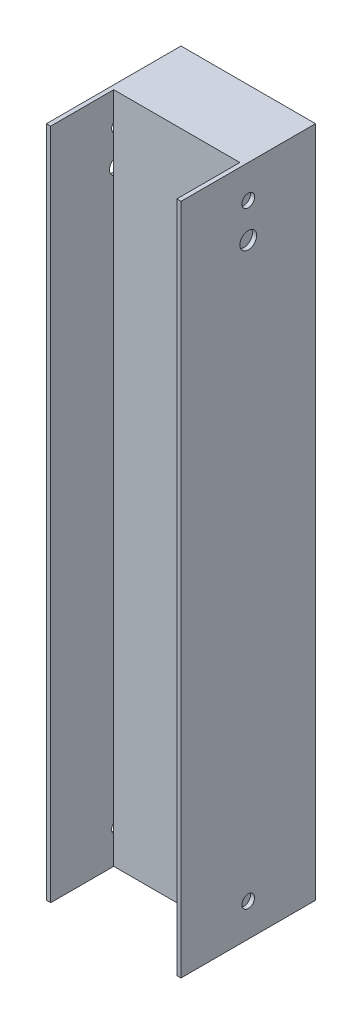
ISO-10303-21;
HEADER;
FILE_DESCRIPTION(('STEP AP214'),'2;1');
FILE_NAME('part.step','',(''),(''),'','','');
FILE_SCHEMA(('AUTOMOTIVE_DESIGN { 1 0 10303 214 1 1 1 1 }'));
ENDSEC;
DATA;
#1=APPLICATION_CONTEXT('core data for automotive mechanical design processes');
#2=APPLICATION_PROTOCOL_DEFINITION('international standard','automotive_design',2000,#1);
#3=PRODUCT_CONTEXT('',#1,'mechanical');
#4=PRODUCT('Part','Part','',(#3));
#5=PRODUCT_RELATED_PRODUCT_CATEGORY('part','',(#4));
#6=PRODUCT_DEFINITION_FORMATION('','',#4);
#7=PRODUCT_DEFINITION_CONTEXT('part definition',#1,'design');
#8=PRODUCT_DEFINITION('design','',#6,#7);
#9=PRODUCT_DEFINITION_SHAPE('','',#8);
#10=(LENGTH_UNIT() NAMED_UNIT(*) SI_UNIT(.MILLI.,.METRE.));
#11=(NAMED_UNIT(*) PLANE_ANGLE_UNIT() SI_UNIT($,.RADIAN.));
#12=(NAMED_UNIT(*) SI_UNIT($,.STERADIAN.) SOLID_ANGLE_UNIT());
#13=UNCERTAINTY_MEASURE_WITH_UNIT(LENGTH_MEASURE(1.E-05),#10,'distance_accuracy_value','');
#14=(GEOMETRIC_REPRESENTATION_CONTEXT(3) GLOBAL_UNCERTAINTY_ASSIGNED_CONTEXT((#13)) GLOBAL_UNIT_ASSIGNED_CONTEXT((#10,
#11,#12)) REPRESENTATION_CONTEXT('',''));
#15=CARTESIAN_POINT('',(0.,0.,0.));
#16=DIRECTION('',(0.,0.,1.));
#17=DIRECTION('',(1.,0.,0.));
#18=AXIS2_PLACEMENT_3D('',#15,#16,#17);
#19=CARTESIAN_POINT('',(-25.4,254.,25.4));
#20=DIRECTION('',(0.,0.,-1.));
#21=DIRECTION('',(-1.,0.,0.));
#22=AXIS2_PLACEMENT_3D('',#19,#20,#21);
#23=PLANE('',#22);
#24=DIRECTION('',(1.,0.,0.));
#25=VECTOR('',#24,1.);
#26=CARTESIAN_POINT('',(-25.4,0.,25.4));
#27=LINE('',#26,#25);
#28=CARTESIAN_POINT('',(-25.4,0.,25.4));
#29=VERTEX_POINT('',#28);
#30=CARTESIAN_POINT('',(-23.8125,0.,25.4));
#31=VERTEX_POINT('',#30);
#32=EDGE_CURVE('E218',#29,#31,#27,.T.);
#33=ORIENTED_EDGE('',*,*,#32,.T.);
#34=DIRECTION('',(0.,-1.,0.));
#35=VECTOR('',#34,1.);
#36=CARTESIAN_POINT('',(-23.8125,254.001,25.4));
#37=LINE('',#36,#35);
#38=CARTESIAN_POINT('',(-23.8125,254.,25.4));
#39=VERTEX_POINT('',#38);
#40=EDGE_CURVE('E310',#39,#31,#37,.T.);
#41=ORIENTED_EDGE('',*,*,#40,.F.);
#42=DIRECTION('',(1.,0.,0.));
#43=VECTOR('',#42,1.);
#44=CARTESIAN_POINT('',(-25.4,254.,25.4));
#45=LINE('',#44,#43);
#46=CARTESIAN_POINT('',(-25.4,254.,25.4));
#47=VERTEX_POINT('',#46);
#48=EDGE_CURVE('E98',#47,#39,#45,.T.);
#49=ORIENTED_EDGE('',*,*,#48,.F.);
#50=DIRECTION('',(0.,-1.,0.));
#51=VECTOR('',#50,1.);
#52=CARTESIAN_POINT('',(-25.4,254.,25.4));
#53=LINE('',#52,#51);
#54=EDGE_CURVE('E11',#47,#29,#53,.T.);
#55=ORIENTED_EDGE('',*,*,#54,.T.);
#56=EDGE_LOOP('',(#33,#41,#49,#55));
#57=FACE_BOUND('',#56,.T.);
#58=ADVANCED_FACE('F43',(#57),#23,.F.);
#59=CARTESIAN_POINT('',(0.,254.,0.));
#60=DIRECTION('',(0.,1.,0.));
#61=DIRECTION('',(0.,0.,1.));
#62=AXIS2_PLACEMENT_3D('',#59,#60,#61);
#63=PLANE('',#62);
#64=DIRECTION('',(0.,0.,1.));
#65=VECTOR('',#64,1.);
#66=CARTESIAN_POINT('',(-23.8125,254.,-23.8125));
#67=LINE('',#66,#65);
#68=CARTESIAN_POINT('',(-23.8125,254.,1.5875));
#69=VERTEX_POINT('',#68);
#70=EDGE_CURVE('E178',#69,#39,#67,.T.);
#71=ORIENTED_EDGE('',*,*,#70,.F.);
#72=DIRECTION('',(-1.,0.,0.));
#73=VECTOR('',#72,1.);
#74=CARTESIAN_POINT('',(-23.8125,254.,1.5875));
#75=LINE('',#74,#73);
#76=CARTESIAN_POINT('',(23.8125,254.,1.5875));
#77=VERTEX_POINT('',#76);
#78=EDGE_CURVE('E162',#77,#69,#75,.T.);
#79=ORIENTED_EDGE('',*,*,#78,.F.);
#80=DIRECTION('',(0.,0.,-1.));
#81=VECTOR('',#80,1.);
#82=CARTESIAN_POINT('',(23.8125,254.,-23.8125));
#83=LINE('',#82,#81);
#84=CARTESIAN_POINT('',(23.8125,254.,25.4));
#85=VERTEX_POINT('',#84);
#86=EDGE_CURVE('E176',#85,#77,#83,.T.);
#87=ORIENTED_EDGE('',*,*,#86,.F.);
#88=CARTESIAN_POINT('',(25.4,254.,25.4));
#89=VERTEX_POINT('',#88);
#90=EDGE_CURVE('E209',#85,#89,#45,.T.);
#91=ORIENTED_EDGE('',*,*,#90,.T.);
#92=DIRECTION('',(0.,0.,-1.));
#93=VECTOR('',#92,1.);
#94=CARTESIAN_POINT('',(25.4,254.,-25.4));
#95=LINE('',#94,#93);
#96=CARTESIAN_POINT('',(25.4,254.,-25.4));
#97=VERTEX_POINT('',#96);
#98=EDGE_CURVE('E212',#89,#97,#95,.T.);
#99=ORIENTED_EDGE('',*,*,#98,.T.);
#100=DIRECTION('',(-1.,0.,0.));
#101=VECTOR('',#100,1.);
#102=CARTESIAN_POINT('',(-25.4,254.,-25.4));
#103=LINE('',#102,#101);
#104=CARTESIAN_POINT('',(-25.4,254.,-25.4));
#105=VERTEX_POINT('',#104);
#106=EDGE_CURVE('E70',#97,#105,#103,.T.);
#107=ORIENTED_EDGE('',*,*,#106,.T.);
#108=DIRECTION('',(0.,0.,1.));
#109=VECTOR('',#108,1.);
#110=CARTESIAN_POINT('',(-25.4,254.,-25.4));
#111=LINE('',#110,#109);
#112=EDGE_CURVE('E206',#105,#47,#111,.T.);
#113=ORIENTED_EDGE('',*,*,#112,.T.);
#114=ORIENTED_EDGE('',*,*,#48,.T.);
#115=EDGE_LOOP('',(#71,#79,#87,#91,#99,#107,#113,#114));
#116=FACE_BOUND('',#115,.T.);
#117=ADVANCED_FACE('F175',(#116),#63,.T.);
#118=CARTESIAN_POINT('',(0.,0.,0.));
#119=DIRECTION('',(0.,1.,0.));
#120=DIRECTION('',(0.,0.,1.));
#121=AXIS2_PLACEMENT_3D('',#118,#119,#120);
#122=PLANE('',#121);
#123=DIRECTION('',(-1.,0.,0.));
#124=VECTOR('',#123,1.);
#125=CARTESIAN_POINT('',(-23.8125,0.,1.5875));
#126=LINE('',#125,#124);
#127=CARTESIAN_POINT('',(23.8125,0.,1.5875));
#128=VERTEX_POINT('',#127);
#129=CARTESIAN_POINT('',(-23.8125,0.,1.5875));
#130=VERTEX_POINT('',#129);
#131=EDGE_CURVE('E180',#128,#130,#126,.T.);
#132=ORIENTED_EDGE('',*,*,#131,.T.);
#133=DIRECTION('',(0.,0.,1.));
#134=VECTOR('',#133,1.);
#135=CARTESIAN_POINT('',(-23.8125,0.,-23.8125));
#136=LINE('',#135,#134);
#137=EDGE_CURVE('E199',#130,#31,#136,.T.);
#138=ORIENTED_EDGE('',*,*,#137,.T.);
#139=ORIENTED_EDGE('',*,*,#32,.F.);
#140=DIRECTION('',(0.,0.,1.));
#141=VECTOR('',#140,1.);
#142=CARTESIAN_POINT('',(-25.4,0.,-25.4));
#143=LINE('',#142,#141);
#144=CARTESIAN_POINT('',(-25.4,0.,-25.4));
#145=VERTEX_POINT('',#144);
#146=EDGE_CURVE('E188',#145,#29,#143,.T.);
#147=ORIENTED_EDGE('',*,*,#146,.F.);
#148=DIRECTION('',(-1.,0.,0.));
#149=VECTOR('',#148,1.);
#150=CARTESIAN_POINT('',(-25.4,0.,-25.4));
#151=LINE('',#150,#149);
#152=CARTESIAN_POINT('',(25.4,0.,-25.4));
#153=VERTEX_POINT('',#152);
#154=EDGE_CURVE('E91',#153,#145,#151,.T.);
#155=ORIENTED_EDGE('',*,*,#154,.F.);
#156=DIRECTION('',(0.,0.,-1.));
#157=VECTOR('',#156,1.);
#158=CARTESIAN_POINT('',(25.4,0.,-25.4));
#159=LINE('',#158,#157);
#160=CARTESIAN_POINT('',(25.4,0.,25.4));
#161=VERTEX_POINT('',#160);
#162=EDGE_CURVE('E222',#161,#153,#159,.T.);
#163=ORIENTED_EDGE('',*,*,#162,.F.);
#164=CARTESIAN_POINT('',(23.8125,0.,25.4));
#165=VERTEX_POINT('',#164);
#166=EDGE_CURVE('E193',#165,#161,#27,.T.);
#167=ORIENTED_EDGE('',*,*,#166,.F.);
#168=DIRECTION('',(0.,0.,-1.));
#169=VECTOR('',#168,1.);
#170=CARTESIAN_POINT('',(23.8125,0.,-23.8125));
#171=LINE('',#170,#169);
#172=EDGE_CURVE('E195',#165,#128,#171,.T.);
#173=ORIENTED_EDGE('',*,*,#172,.T.);
#174=EDGE_LOOP('',(#132,#138,#139,#147,#155,#163,#167,#173));
#175=FACE_BOUND('',#174,.T.);
#176=ADVANCED_FACE('F360',(#175),#122,.F.);
#177=CARTESIAN_POINT('',(-25.4,254.,-25.4));
#178=DIRECTION('',(1.,0.,0.));
#179=DIRECTION('',(0.,0.,-1.));
#180=AXIS2_PLACEMENT_3D('',#177,#178,#179);
#181=PLANE('',#180);
#182=CARTESIAN_POINT('',(-25.4,228.6,0.));
#183=DIRECTION('',(1.,0.,0.));
#184=DIRECTION('',(0.,0.,-1.));
#185=AXIS2_PLACEMENT_3D('',#182,#183,#184);
#186=CIRCLE('',#185,3.175);
#187=CARTESIAN_POINT('',(-25.4,228.6,-3.175));
#188=VERTEX_POINT('',#187);
#189=EDGE_CURVE('E317',#188,#188,#186,.T.);
#190=ORIENTED_EDGE('',*,*,#189,.T.);
#191=EDGE_LOOP('',(#190));
#192=FACE_BOUND('',#191,.T.);
#193=CARTESIAN_POINT('',(-25.4,12.412400118,0.));
#194=DIRECTION('',(1.,0.,0.));
#195=DIRECTION('',(0.,0.,-1.));
#196=AXIS2_PLACEMENT_3D('',#193,#194,#195);
#197=CIRCLE('',#196,2.3999952);
#198=CARTESIAN_POINT('',(-25.4,12.412400118,-2.39999519999999));
#199=VERTEX_POINT('',#198);
#200=EDGE_CURVE('E250',#199,#199,#197,.T.);
#201=ORIENTED_EDGE('',*,*,#200,.T.);
#202=EDGE_LOOP('',(#201));
#203=FACE_BOUND('',#202,.T.);
#204=CARTESIAN_POINT('',(-25.4,241.587599882,0.));
#205=DIRECTION('',(1.,0.,0.));
#206=DIRECTION('',(0.,0.,-1.));
#207=AXIS2_PLACEMENT_3D('',#204,#205,#206);
#208=CIRCLE('',#207,2.39999520000001);
#209=CARTESIAN_POINT('',(-25.4,241.587599882,-2.39999520000001));
#210=VERTEX_POINT('',#209);
#211=EDGE_CURVE('E271',#210,#210,#208,.T.);
#212=ORIENTED_EDGE('',*,*,#211,.T.);
#213=EDGE_LOOP('',(#212));
#214=FACE_BOUND('',#213,.T.);
#215=ORIENTED_EDGE('',*,*,#146,.T.);
#216=ORIENTED_EDGE('',*,*,#54,.F.);
#217=ORIENTED_EDGE('',*,*,#112,.F.);
#218=DIRECTION('',(0.,-1.,0.));
#219=VECTOR('',#218,1.);
#220=CARTESIAN_POINT('',(-25.4,254.,-25.4));
#221=LINE('',#220,#219);
#222=EDGE_CURVE('E216',#105,#145,#221,.T.);
#223=ORIENTED_EDGE('',*,*,#222,.T.);
#224=EDGE_LOOP('',(#215,#216,#217,#223));
#225=FACE_BOUND('',#224,.T.);
#226=ADVANCED_FACE('F45',(#192,#203,#214,#225),#181,.F.);
#227=ORIENTED_EDGE('',*,*,#90,.F.);
#228=DIRECTION('',(0.,-1.,0.));
#229=VECTOR('',#228,1.);
#230=CARTESIAN_POINT('',(23.8125,254.001,25.4));
#231=LINE('',#230,#229);
#232=EDGE_CURVE('E185',#85,#165,#231,.T.);
#233=ORIENTED_EDGE('',*,*,#232,.T.);
#234=ORIENTED_EDGE('',*,*,#166,.T.);
#235=DIRECTION('',(0.,-1.,0.));
#236=VECTOR('',#235,1.);
#237=CARTESIAN_POINT('',(25.4,254.,25.4));
#238=LINE('',#237,#236);
#239=EDGE_CURVE('E53',#89,#161,#238,.T.);
#240=ORIENTED_EDGE('',*,*,#239,.F.);
#241=EDGE_LOOP('',(#227,#233,#234,#240));
#242=FACE_BOUND('',#241,.T.);
#243=ADVANCED_FACE('F354',(#242),#23,.F.);
#244=CARTESIAN_POINT('',(25.4,254.,-25.4));
#245=DIRECTION('',(-1.,0.,0.));
#246=DIRECTION('',(0.,0.,1.));
#247=AXIS2_PLACEMENT_3D('',#244,#245,#246);
#248=PLANE('',#247);
#249=CARTESIAN_POINT('',(25.4,228.6,0.));
#250=DIRECTION('',(1.,0.,0.));
#251=DIRECTION('',(0.,0.,-1.));
#252=AXIS2_PLACEMENT_3D('',#249,#250,#251);
#253=CIRCLE('',#252,3.175);
#254=CARTESIAN_POINT('',(25.4,228.6,-3.175));
#255=VERTEX_POINT('',#254);
#256=EDGE_CURVE('E314',#255,#255,#253,.T.);
#257=ORIENTED_EDGE('',*,*,#256,.F.);
#258=EDGE_LOOP('',(#257));
#259=FACE_BOUND('',#258,.T.);
#260=CARTESIAN_POINT('',(25.4,12.412400118,0.));
#261=DIRECTION('',(-1.,0.,0.));
#262=DIRECTION('',(0.,0.,1.));
#263=AXIS2_PLACEMENT_3D('',#260,#261,#262);
#264=CIRCLE('',#263,2.3999952);
#265=CARTESIAN_POINT('',(25.4,12.412400118,2.3999952));
#266=VERTEX_POINT('',#265);
#267=EDGE_CURVE('E248',#266,#266,#264,.T.);
#268=ORIENTED_EDGE('',*,*,#267,.T.);
#269=EDGE_LOOP('',(#268));
#270=FACE_BOUND('',#269,.T.);
#271=CARTESIAN_POINT('',(25.4,241.587599882,0.));
#272=DIRECTION('',(1.,0.,0.));
#273=DIRECTION('',(0.,0.,-1.));
#274=AXIS2_PLACEMENT_3D('',#271,#272,#273);
#275=CIRCLE('',#274,2.39999520000001);
#276=CARTESIAN_POINT('',(25.4,241.587599882,-2.39999520000001));
#277=VERTEX_POINT('',#276);
#278=EDGE_CURVE('E275',#277,#277,#275,.T.);
#279=ORIENTED_EDGE('',*,*,#278,.F.);
#280=EDGE_LOOP('',(#279));
#281=FACE_BOUND('',#280,.T.);
#282=ORIENTED_EDGE('',*,*,#162,.T.);
#283=DIRECTION('',(0.,-1.,0.));
#284=VECTOR('',#283,1.);
#285=CARTESIAN_POINT('',(25.4,254.,-25.4));
#286=LINE('',#285,#284);
#287=EDGE_CURVE('E229',#97,#153,#286,.T.);
#288=ORIENTED_EDGE('',*,*,#287,.F.);
#289=ORIENTED_EDGE('',*,*,#98,.F.);
#290=ORIENTED_EDGE('',*,*,#239,.T.);
#291=EDGE_LOOP('',(#282,#288,#289,#290));
#292=FACE_BOUND('',#291,.T.);
#293=ADVANCED_FACE('F363',(#259,#270,#281,#292),#248,.F.);
#294=CARTESIAN_POINT('',(-25.4,254.,-25.4));
#295=DIRECTION('',(0.,0.,1.));
#296=DIRECTION('',(1.,0.,0.));
#297=AXIS2_PLACEMENT_3D('',#294,#295,#296);
#298=PLANE('',#297);
#299=CARTESIAN_POINT('',(0.,228.6,-25.4));
#300=DIRECTION('',(0.,0.,1.));
#301=DIRECTION('',(1.,0.,0.));
#302=AXIS2_PLACEMENT_3D('',#299,#300,#301);
#303=CIRCLE('',#302,3.175);
#304=CARTESIAN_POINT('',(3.175,228.6,-25.4));
#305=VERTEX_POINT('',#304);
#306=EDGE_CURVE('E260',#305,#305,#303,.T.);
#307=ORIENTED_EDGE('',*,*,#306,.T.);
#308=EDGE_LOOP('',(#307));
#309=FACE_BOUND('',#308,.T.);
#310=CARTESIAN_POINT('',(0.,12.412400118,-25.4));
#311=DIRECTION('',(0.,0.,-1.));
#312=DIRECTION('',(-1.,0.,0.));
#313=AXIS2_PLACEMENT_3D('',#310,#311,#312);
#314=CIRCLE('',#313,2.3999952);
#315=CARTESIAN_POINT('',(-2.39999520000001,12.412400118,-25.4));
#316=VERTEX_POINT('',#315);
#317=EDGE_CURVE('E254',#316,#316,#314,.T.);
#318=ORIENTED_EDGE('',*,*,#317,.F.);
#319=EDGE_LOOP('',(#318));
#320=FACE_BOUND('',#319,.T.);
#321=CARTESIAN_POINT('',(0.,241.587599882,-25.4));
#322=DIRECTION('',(0.,0.,-1.));
#323=DIRECTION('',(-1.,0.,0.));
#324=AXIS2_PLACEMENT_3D('',#321,#322,#323);
#325=CIRCLE('',#324,2.39999520000001);
#326=CARTESIAN_POINT('',(-2.39999520000001,241.587599882,-25.4));
#327=VERTEX_POINT('',#326);
#328=EDGE_CURVE('E267',#327,#327,#325,.T.);
#329=ORIENTED_EDGE('',*,*,#328,.F.);
#330=EDGE_LOOP('',(#329));
#331=FACE_BOUND('',#330,.T.);
#332=ORIENTED_EDGE('',*,*,#154,.T.);
#333=ORIENTED_EDGE('',*,*,#222,.F.);
#334=ORIENTED_EDGE('',*,*,#106,.F.);
#335=ORIENTED_EDGE('',*,*,#287,.T.);
#336=EDGE_LOOP('',(#332,#333,#334,#335));
#337=FACE_BOUND('',#336,.T.);
#338=ADVANCED_FACE('F333',(#309,#320,#331,#337),#298,.F.);
#339=CARTESIAN_POINT('',(-23.8125,254.,-23.8125));
#340=DIRECTION('',(1.,0.,0.));
#341=DIRECTION('',(0.,0.,-1.));
#342=AXIS2_PLACEMENT_3D('',#339,#340,#341);
#343=PLANE('',#342);
#344=DIRECTION('',(0.,-1.,0.));
#345=VECTOR('',#344,1.);
#346=CARTESIAN_POINT('',(-23.8125,254.,1.5875));
#347=LINE('',#346,#345);
#348=CARTESIAN_POINT('',(-23.8125,243.38755007854,1.5875));
#349=VERTEX_POINT('',#348);
#350=EDGE_CURVE('E283',#69,#349,#347,.T.);
#351=ORIENTED_EDGE('',*,*,#350,.F.);
#352=ORIENTED_EDGE('',*,*,#70,.T.);
#353=ORIENTED_EDGE('',*,*,#40,.T.);
#354=ORIENTED_EDGE('',*,*,#137,.F.);
#355=CARTESIAN_POINT('',(-23.8125,10.6124499214604,1.5875));
#356=VERTEX_POINT('',#355);
#357=EDGE_CURVE('E171',#356,#130,#347,.T.);
#358=ORIENTED_EDGE('',*,*,#357,.F.);
#359=CARTESIAN_POINT('',(-23.8125,12.412400118,0.));
#360=DIRECTION('',(1.,0.,0.));
#361=DIRECTION('',(0.,0.,-1.));
#362=AXIS2_PLACEMENT_3D('',#359,#360,#361);
#363=CIRCLE('',#362,2.3999952);
#364=CARTESIAN_POINT('',(-23.8125,14.2123503145396,1.5875));
#365=VERTEX_POINT('',#364);
#366=EDGE_CURVE('E241',#365,#356,#363,.T.);
#367=ORIENTED_EDGE('',*,*,#366,.F.);
#368=CARTESIAN_POINT('',(-23.8125,225.850369342984,1.5875));
#369=VERTEX_POINT('',#368);
#370=EDGE_CURVE('E426',#369,#365,#347,.T.);
#371=ORIENTED_EDGE('',*,*,#370,.F.);
#372=CARTESIAN_POINT('',(-23.8125,228.6,0.));
#373=DIRECTION('',(1.,0.,0.));
#374=DIRECTION('',(0.,0.,-1.));
#375=AXIS2_PLACEMENT_3D('',#372,#373,#374);
#376=CIRCLE('',#375,3.175);
#377=CARTESIAN_POINT('',(-23.8125,231.349630657016,1.5875));
#378=VERTEX_POINT('',#377);
#379=EDGE_CURVE('E325',#378,#369,#376,.T.);
#380=ORIENTED_EDGE('',*,*,#379,.F.);
#381=CARTESIAN_POINT('',(-23.8125,239.78764968546,1.5875));
#382=VERTEX_POINT('',#381);
#383=EDGE_CURVE('E61',#382,#378,#347,.T.);
#384=ORIENTED_EDGE('',*,*,#383,.F.);
#385=CARTESIAN_POINT('',(-23.8125,241.587599882,0.));
#386=DIRECTION('',(1.,0.,0.));
#387=DIRECTION('',(0.,0.,-1.));
#388=AXIS2_PLACEMENT_3D('',#385,#386,#387);
#389=CIRCLE('',#388,2.39999520000001);
#390=EDGE_CURVE('E202',#382,#349,#389,.F.);
#391=ORIENTED_EDGE('',*,*,#390,.T.);
#392=EDGE_LOOP('',(#351,#352,#353,#354,#358,#367,#371,#380,#384,#391));
#393=FACE_BOUND('',#392,.T.);
#394=ADVANCED_FACE('F282',(#393),#343,.T.);
#395=CARTESIAN_POINT('',(23.8125,254.,-23.8125));
#396=DIRECTION('',(-1.,0.,0.));
#397=DIRECTION('',(0.,0.,1.));
#398=AXIS2_PLACEMENT_3D('',#395,#396,#397);
#399=PLANE('',#398);
#400=DIRECTION('',(0.,-1.,0.));
#401=VECTOR('',#400,1.);
#402=CARTESIAN_POINT('',(23.8125,254.,1.5875));
#403=LINE('',#402,#401);
#404=CARTESIAN_POINT('',(23.8125,10.6124499214604,1.5875));
#405=VERTEX_POINT('',#404);
#406=EDGE_CURVE('E173',#405,#128,#403,.T.);
#407=ORIENTED_EDGE('',*,*,#406,.T.);
#408=ORIENTED_EDGE('',*,*,#172,.F.);
#409=ORIENTED_EDGE('',*,*,#232,.F.);
#410=ORIENTED_EDGE('',*,*,#86,.T.);
#411=CARTESIAN_POINT('',(23.8125,243.38755007854,1.5875));
#412=VERTEX_POINT('',#411);
#413=EDGE_CURVE('E158',#77,#412,#403,.T.);
#414=ORIENTED_EDGE('',*,*,#413,.T.);
#415=CARTESIAN_POINT('',(23.8125,241.587599882,0.));
#416=DIRECTION('',(-1.,0.,0.));
#417=DIRECTION('',(0.,0.,1.));
#418=AXIS2_PLACEMENT_3D('',#415,#416,#417);
#419=CIRCLE('',#418,2.39999520000001);
#420=CARTESIAN_POINT('',(23.8125,239.78764968546,1.5875));
#421=VERTEX_POINT('',#420);
#422=EDGE_CURVE('E237',#412,#421,#419,.F.);
#423=ORIENTED_EDGE('',*,*,#422,.T.);
#424=CARTESIAN_POINT('',(23.8125,231.349630657016,1.5875));
#425=VERTEX_POINT('',#424);
#426=EDGE_CURVE('E501',#421,#425,#403,.T.);
#427=ORIENTED_EDGE('',*,*,#426,.T.);
#428=CARTESIAN_POINT('',(23.8125,228.6,0.));
#429=DIRECTION('',(-1.,0.,0.));
#430=DIRECTION('',(0.,0.,1.));
#431=AXIS2_PLACEMENT_3D('',#428,#429,#430);
#432=CIRCLE('',#431,3.175);
#433=CARTESIAN_POINT('',(23.8125,225.850369342984,1.5875));
#434=VERTEX_POINT('',#433);
#435=EDGE_CURVE('E321',#434,#425,#432,.T.);
#436=ORIENTED_EDGE('',*,*,#435,.F.);
#437=CARTESIAN_POINT('',(23.8125,14.2123503145396,1.5875));
#438=VERTEX_POINT('',#437);
#439=EDGE_CURVE('E491',#434,#438,#403,.T.);
#440=ORIENTED_EDGE('',*,*,#439,.T.);
#441=CARTESIAN_POINT('',(23.8125,12.412400118,0.));
#442=DIRECTION('',(-1.,0.,0.));
#443=DIRECTION('',(0.,0.,1.));
#444=AXIS2_PLACEMENT_3D('',#441,#442,#443);
#445=CIRCLE('',#444,2.3999952);
#446=EDGE_CURVE('E242',#405,#438,#445,.T.);
#447=ORIENTED_EDGE('',*,*,#446,.F.);
#448=EDGE_LOOP('',(#407,#408,#409,#410,#414,#423,#427,#436,#440,#447));
#449=FACE_BOUND('',#448,.T.);
#450=ADVANCED_FACE('F183',(#449),#399,.T.);
#451=CARTESIAN_POINT('',(25.4,241.587599882,0.));
#452=DIRECTION('',(-1.,0.,0.));
#453=DIRECTION('',(0.,0.,1.));
#454=AXIS2_PLACEMENT_3D('',#451,#452,#453);
#455=CYLINDRICAL_SURFACE('',#454,2.39999520000001);
#456=EDGE_CURVE('E235',#421,#412,#419,.F.);
#457=ORIENTED_EDGE('',*,*,#456,.F.);
#458=ORIENTED_EDGE('',*,*,#422,.F.);
#459=EDGE_LOOP('',(#457,#458));
#460=FACE_BOUND('',#459,.T.);
#461=ORIENTED_EDGE('',*,*,#278,.T.);
#462=EDGE_LOOP('',(#461));
#463=FACE_BOUND('',#462,.T.);
#464=ADVANCED_FACE('F398',(#460,#463),#455,.F.);
#465=ORIENTED_EDGE('',*,*,#390,.F.);
#466=CARTESIAN_POINT('',(-23.8125,241.587599882,0.));
#467=DIRECTION('',(-1.,0.,0.));
#468=DIRECTION('',(0.,0.,1.));
#469=AXIS2_PLACEMENT_3D('',#466,#467,#468);
#470=CIRCLE('',#469,2.39999520000001);
#471=EDGE_CURVE('E289',#349,#382,#470,.T.);
#472=ORIENTED_EDGE('',*,*,#471,.F.);
#473=EDGE_LOOP('',(#465,#472));
#474=FACE_BOUND('',#473,.T.);
#475=ORIENTED_EDGE('',*,*,#211,.F.);
#476=EDGE_LOOP('',(#475));
#477=FACE_BOUND('',#476,.T.);
#478=ADVANCED_FACE('F287',(#474,#477),#455,.F.);
#479=CARTESIAN_POINT('',(0.,241.587599882,25.4));
#480=DIRECTION('',(0.,0.,-1.));
#481=DIRECTION('',(-1.,0.,0.));
#482=AXIS2_PLACEMENT_3D('',#479,#480,#481);
#483=CYLINDRICAL_SURFACE('',#482,2.39999520000001);
#484=CARTESIAN_POINT('',(0.,241.587599882,-23.8125));
#485=DIRECTION('',(0.,0.,-1.));
#486=DIRECTION('',(-1.,0.,0.));
#487=AXIS2_PLACEMENT_3D('',#484,#485,#486);
#488=CIRCLE('',#487,2.39999520000001);
#489=CARTESIAN_POINT('',(-2.39999520000001,241.587599882,-23.8125));
#490=VERTEX_POINT('',#489);
#491=EDGE_CURVE('E306',#490,#490,#488,.F.);
#492=ORIENTED_EDGE('',*,*,#491,.T.);
#493=EDGE_LOOP('',(#492));
#494=FACE_BOUND('',#493,.T.);
#495=ORIENTED_EDGE('',*,*,#328,.T.);
#496=EDGE_LOOP('',(#495));
#497=FACE_BOUND('',#496,.T.);
#498=ADVANCED_FACE('F402',(#494,#497),#483,.F.);
#499=CARTESIAN_POINT('',(-25.4,12.412400118,0.));
#500=DIRECTION('',(1.,0.,0.));
#501=DIRECTION('',(0.,0.,-1.));
#502=AXIS2_PLACEMENT_3D('',#499,#500,#501);
#503=CYLINDRICAL_SURFACE('',#502,2.3999952);
#504=EDGE_CURVE('E238',#438,#405,#445,.T.);
#505=ORIENTED_EDGE('',*,*,#504,.T.);
#506=ORIENTED_EDGE('',*,*,#446,.T.);
#507=EDGE_LOOP('',(#505,#506));
#508=FACE_BOUND('',#507,.T.);
#509=ORIENTED_EDGE('',*,*,#267,.F.);
#510=EDGE_LOOP('',(#509));
#511=FACE_BOUND('',#510,.T.);
#512=ADVANCED_FACE('F405',(#508,#511),#503,.F.);
#513=ORIENTED_EDGE('',*,*,#366,.T.);
#514=CARTESIAN_POINT('',(-23.8125,12.412400118,0.));
#515=DIRECTION('',(-1.,0.,0.));
#516=DIRECTION('',(0.,0.,1.));
#517=AXIS2_PLACEMENT_3D('',#514,#515,#516);
#518=CIRCLE('',#517,2.3999952);
#519=EDGE_CURVE('E293',#356,#365,#518,.F.);
#520=ORIENTED_EDGE('',*,*,#519,.T.);
#521=EDGE_LOOP('',(#513,#520));
#522=FACE_BOUND('',#521,.T.);
#523=ORIENTED_EDGE('',*,*,#200,.F.);
#524=EDGE_LOOP('',(#523));
#525=FACE_BOUND('',#524,.T.);
#526=ADVANCED_FACE('F350',(#522,#525),#503,.F.);
#527=CARTESIAN_POINT('',(0.,12.412400118,25.4));
#528=DIRECTION('',(0.,0.,-1.));
#529=DIRECTION('',(-1.,0.,0.));
#530=AXIS2_PLACEMENT_3D('',#527,#528,#529);
#531=CYLINDRICAL_SURFACE('',#530,2.3999952);
#532=CARTESIAN_POINT('',(0.,12.412400118,-23.8125));
#533=DIRECTION('',(0.,0.,-1.));
#534=DIRECTION('',(-1.,0.,0.));
#535=AXIS2_PLACEMENT_3D('',#532,#533,#534);
#536=CIRCLE('',#535,2.3999952);
#537=CARTESIAN_POINT('',(-2.39999520000001,12.412400118,-23.8125));
#538=VERTEX_POINT('',#537);
#539=EDGE_CURVE('E298',#538,#538,#536,.F.);
#540=ORIENTED_EDGE('',*,*,#539,.T.);
#541=EDGE_LOOP('',(#540));
#542=FACE_BOUND('',#541,.T.);
#543=ORIENTED_EDGE('',*,*,#317,.T.);
#544=EDGE_LOOP('',(#543));
#545=FACE_BOUND('',#544,.T.);
#546=ADVANCED_FACE('F339',(#542,#545),#531,.F.);
#547=CARTESIAN_POINT('',(0.,228.6,25.4));
#548=DIRECTION('',(0.,0.,-1.));
#549=DIRECTION('',(-1.,0.,0.));
#550=AXIS2_PLACEMENT_3D('',#547,#548,#549);
#551=CYLINDRICAL_SURFACE('',#550,3.175);
#552=CARTESIAN_POINT('',(0.,228.6,-23.8125));
#553=DIRECTION('',(0.,0.,-1.));
#554=DIRECTION('',(-1.,0.,0.));
#555=AXIS2_PLACEMENT_3D('',#552,#553,#554);
#556=CIRCLE('',#555,3.175);
#557=CARTESIAN_POINT('',(-3.175,228.6,-23.8125));
#558=VERTEX_POINT('',#557);
#559=EDGE_CURVE('E292',#558,#558,#556,.F.);
#560=ORIENTED_EDGE('',*,*,#559,.T.);
#561=EDGE_LOOP('',(#560));
#562=FACE_BOUND('',#561,.T.);
#563=ORIENTED_EDGE('',*,*,#306,.F.);
#564=EDGE_LOOP('',(#563));
#565=FACE_BOUND('',#564,.T.);
#566=ADVANCED_FACE('F336',(#562,#565),#551,.F.);
#567=CARTESIAN_POINT('',(-25.4,228.6,0.));
#568=DIRECTION('',(1.,0.,0.));
#569=DIRECTION('',(0.,0.,-1.));
#570=AXIS2_PLACEMENT_3D('',#567,#568,#569);
#571=CYLINDRICAL_SURFACE('',#570,3.175);
#572=EDGE_CURVE('E47',#425,#434,#432,.T.);
#573=ORIENTED_EDGE('',*,*,#572,.T.);
#574=ORIENTED_EDGE('',*,*,#435,.T.);
#575=EDGE_LOOP('',(#573,#574));
#576=FACE_BOUND('',#575,.T.);
#577=ORIENTED_EDGE('',*,*,#256,.T.);
#578=EDGE_LOOP('',(#577));
#579=FACE_BOUND('',#578,.T.);
#580=ADVANCED_FACE('F338',(#576,#579),#571,.F.);
#581=ORIENTED_EDGE('',*,*,#379,.T.);
#582=EDGE_CURVE('E328',#369,#378,#376,.T.);
#583=ORIENTED_EDGE('',*,*,#582,.T.);
#584=EDGE_LOOP('',(#581,#583));
#585=FACE_BOUND('',#584,.T.);
#586=ORIENTED_EDGE('',*,*,#189,.F.);
#587=EDGE_LOOP('',(#586));
#588=FACE_BOUND('',#587,.T.);
#589=ADVANCED_FACE('F347',(#585,#588),#571,.F.);
#590=CARTESIAN_POINT('',(23.8125,254.,-23.8125));
#591=DIRECTION('',(1.,0.,0.));
#592=DIRECTION('',(0.,0.,-1.));
#593=AXIS2_PLACEMENT_3D('',#590,#591,#592);
#594=PLANE('',#593);
#595=EDGE_CURVE('E165',#412,#421,#403,.T.);
#596=ORIENTED_EDGE('',*,*,#595,.T.);
#597=ORIENTED_EDGE('',*,*,#456,.T.);
#598=EDGE_LOOP('',(#596,#597));
#599=FACE_BOUND('',#598,.T.);
#600=ADVANCED_FACE('F455',(#599),#594,.T.);
#601=CARTESIAN_POINT('',(-23.8125,254.,1.5875));
#602=DIRECTION('',(0.,0.,1.));
#603=DIRECTION('',(1.,0.,0.));
#604=AXIS2_PLACEMENT_3D('',#601,#602,#603);
#605=PLANE('',#604);
#606=ORIENTED_EDGE('',*,*,#131,.F.);
#607=ORIENTED_EDGE('',*,*,#406,.F.);
#608=EDGE_CURVE('E488',#438,#405,#403,.T.);
#609=ORIENTED_EDGE('',*,*,#608,.F.);
#610=ORIENTED_EDGE('',*,*,#439,.F.);
#611=EDGE_CURVE('E499',#425,#434,#403,.T.);
#612=ORIENTED_EDGE('',*,*,#611,.F.);
#613=ORIENTED_EDGE('',*,*,#426,.F.);
#614=ORIENTED_EDGE('',*,*,#595,.F.);
#615=ORIENTED_EDGE('',*,*,#413,.F.);
#616=ORIENTED_EDGE('',*,*,#78,.T.);
#617=ORIENTED_EDGE('',*,*,#350,.T.);
#618=EDGE_CURVE('E435',#349,#382,#347,.T.);
#619=ORIENTED_EDGE('',*,*,#618,.T.);
#620=ORIENTED_EDGE('',*,*,#383,.T.);
#621=EDGE_CURVE('E438',#378,#369,#347,.T.);
#622=ORIENTED_EDGE('',*,*,#621,.T.);
#623=ORIENTED_EDGE('',*,*,#370,.T.);
#624=EDGE_CURVE('E430',#365,#356,#347,.T.);
#625=ORIENTED_EDGE('',*,*,#624,.T.);
#626=ORIENTED_EDGE('',*,*,#357,.T.);
#627=EDGE_LOOP('',(#606,#607,#609,#610,#612,#613,#614,#615,#616,#617,#619,#620,#622,#623,#625,#626));
#628=FACE_BOUND('',#627,.T.);
#629=ADVANCED_FACE('F160',(#628),#605,.T.);
#630=CARTESIAN_POINT('',(-23.8125,254.,-23.8125));
#631=DIRECTION('',(-1.,0.,0.));
#632=DIRECTION('',(0.,0.,1.));
#633=AXIS2_PLACEMENT_3D('',#630,#631,#632);
#634=PLANE('',#633);
#635=ORIENTED_EDGE('',*,*,#618,.F.);
#636=ORIENTED_EDGE('',*,*,#471,.T.);
#637=EDGE_LOOP('',(#635,#636));
#638=FACE_BOUND('',#637,.T.);
#639=ADVANCED_FACE('F447',(#638),#634,.T.);
#640=ORIENTED_EDGE('',*,*,#582,.F.);
#641=ORIENTED_EDGE('',*,*,#621,.F.);
#642=EDGE_LOOP('',(#640,#641));
#643=FACE_BOUND('',#642,.T.);
#644=ADVANCED_FACE('F445',(#643),#634,.T.);
#645=ORIENTED_EDGE('',*,*,#519,.F.);
#646=ORIENTED_EDGE('',*,*,#624,.F.);
#647=EDGE_LOOP('',(#645,#646));
#648=FACE_BOUND('',#647,.T.);
#649=ADVANCED_FACE('F442',(#648),#634,.T.);
#650=ORIENTED_EDGE('',*,*,#572,.F.);
#651=ORIENTED_EDGE('',*,*,#611,.T.);
#652=EDGE_LOOP('',(#650,#651));
#653=FACE_BOUND('',#652,.T.);
#654=ADVANCED_FACE('F444',(#653),#594,.T.);
#655=ORIENTED_EDGE('',*,*,#504,.F.);
#656=ORIENTED_EDGE('',*,*,#608,.T.);
#657=EDGE_LOOP('',(#655,#656));
#658=FACE_BOUND('',#657,.T.);
#659=ADVANCED_FACE('F452',(#658),#594,.T.);
#660=CARTESIAN_POINT('',(-23.8125,254.,-23.8125));
#661=DIRECTION('',(0.,0.,-1.));
#662=DIRECTION('',(-1.,0.,0.));
#663=AXIS2_PLACEMENT_3D('',#660,#661,#662);
#664=PLANE('',#663);
#665=ORIENTED_EDGE('',*,*,#559,.F.);
#666=EDGE_LOOP('',(#665));
#667=FACE_BOUND('',#666,.T.);
#668=ADVANCED_FACE('F471',(#667),#664,.T.);
#669=ORIENTED_EDGE('',*,*,#539,.F.);
#670=EDGE_LOOP('',(#669));
#671=FACE_BOUND('',#670,.T.);
#672=ADVANCED_FACE('F469',(#671),#664,.T.);
#673=ORIENTED_EDGE('',*,*,#491,.F.);
#674=EDGE_LOOP('',(#673));
#675=FACE_BOUND('',#674,.T.);
#676=ADVANCED_FACE('F467',(#675),#664,.T.);
#677=CLOSED_SHELL('',(#58,#117,#176,#226,#243,#293,#338,#394,#450,#464,#478,#498,#512,#526,#546,
#566,#580,#589,#600,#629,#639,#644,#649,#654,#659,#668,#672,#676));
#678=MANIFOLD_SOLID_BREP('B2',#677);
#679=ADVANCED_BREP_SHAPE_REPRESENTATION('',(#18,#678),#14);
#680=SHAPE_DEFINITION_REPRESENTATION(#9,#679);
ENDSEC;
END-ISO-10303-21;
